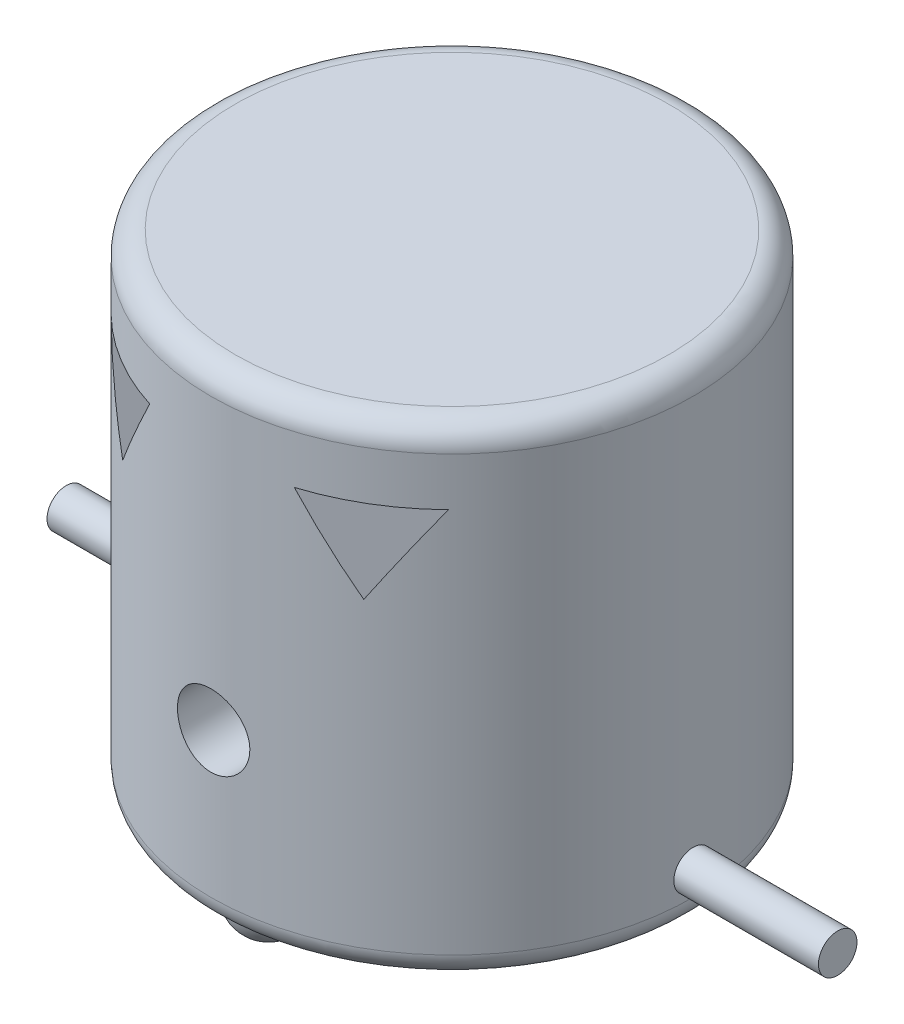
ISO-10303-21;
HEADER;
FILE_DESCRIPTION(('STEP AP214'),'2;1');
FILE_NAME('part.step','',(''),(''),'','','');
FILE_SCHEMA(('AUTOMOTIVE_DESIGN { 1 0 10303 214 1 1 1 1 }'));
ENDSEC;
DATA;
#1=APPLICATION_CONTEXT('core data for automotive mechanical design processes');
#2=APPLICATION_PROTOCOL_DEFINITION('international standard','automotive_design',2000,#1);
#3=PRODUCT_CONTEXT('',#1,'mechanical');
#4=PRODUCT('Part','Part','',(#3));
#5=PRODUCT_RELATED_PRODUCT_CATEGORY('part','',(#4));
#6=PRODUCT_DEFINITION_FORMATION('','',#4);
#7=PRODUCT_DEFINITION_CONTEXT('part definition',#1,'design');
#8=PRODUCT_DEFINITION('design','',#6,#7);
#9=PRODUCT_DEFINITION_SHAPE('','',#8);
#10=(LENGTH_UNIT() NAMED_UNIT(*) SI_UNIT(.MILLI.,.METRE.));
#11=(NAMED_UNIT(*) PLANE_ANGLE_UNIT() SI_UNIT($,.RADIAN.));
#12=(NAMED_UNIT(*) SI_UNIT($,.STERADIAN.) SOLID_ANGLE_UNIT());
#13=UNCERTAINTY_MEASURE_WITH_UNIT(LENGTH_MEASURE(1.E-05),#10,'distance_accuracy_value','');
#14=(GEOMETRIC_REPRESENTATION_CONTEXT(3) GLOBAL_UNCERTAINTY_ASSIGNED_CONTEXT((#13)) GLOBAL_UNIT_ASSIGNED_CONTEXT((#10,
#11,#12)) REPRESENTATION_CONTEXT('',''));
#15=CARTESIAN_POINT('',(0.,0.,0.));
#16=DIRECTION('',(0.,0.,1.));
#17=DIRECTION('',(1.,0.,0.));
#18=AXIS2_PLACEMENT_3D('',#15,#16,#17);
#19=CARTESIAN_POINT('',(-80.,10.,0.));
#20=DIRECTION('',(1.,0.,0.));
#21=DIRECTION('',(0.,0.,-1.));
#22=AXIS2_PLACEMENT_3D('',#19,#20,#21);
#23=CYLINDRICAL_SURFACE('',#22,4.);
#24=CARTESIAN_POINT('',(-80.,10.,0.));
#25=DIRECTION('',(-1.,0.,0.));
#26=DIRECTION('',(0.,0.,1.));
#27=AXIS2_PLACEMENT_3D('',#24,#25,#26);
#28=CIRCLE('',#27,4.);
#29=CARTESIAN_POINT('',(-80.,10.,4.));
#30=VERTEX_POINT('',#29);
#31=EDGE_CURVE('E11',#30,#30,#28,.T.);
#32=ORIENTED_EDGE('',*,*,#31,.F.);
#33=EDGE_LOOP('',(#32));
#34=FACE_BOUND('',#33,.T.);
#35=CARTESIAN_POINT('',(-50.,10.,0.));
#36=DIRECTION('',(-1.,0.,0.));
#37=DIRECTION('',(0.,0.,1.));
#38=AXIS2_PLACEMENT_3D('',#35,#36,#37);
#39=CIRCLE('',#38,4.);
#40=CARTESIAN_POINT('',(-50.,10.,4.));
#41=VERTEX_POINT('',#40);
#42=EDGE_CURVE('E48',#41,#41,#39,.T.);
#43=ORIENTED_EDGE('',*,*,#42,.T.);
#44=EDGE_LOOP('',(#43));
#45=FACE_BOUND('',#44,.T.);
#46=ADVANCED_FACE('F45',(#34,#45),#23,.T.);
#47=CARTESIAN_POINT('',(-80.,10.,0.));
#48=DIRECTION('',(-1.,0.,0.));
#49=DIRECTION('',(0.,0.,1.));
#50=AXIS2_PLACEMENT_3D('',#47,#48,#49);
#51=PLANE('',#50);
#52=ORIENTED_EDGE('',*,*,#31,.T.);
#53=EDGE_LOOP('',(#52));
#54=FACE_BOUND('',#53,.T.);
#55=ADVANCED_FACE('F60',(#54),#51,.T.);
#56=CARTESIAN_POINT('',(-50.,10.,0.));
#57=DIRECTION('',(-1.,0.,0.));
#58=DIRECTION('',(0.,0.,1.));
#59=AXIS2_PLACEMENT_3D('',#56,#57,#58);
#60=PLANE('',#59);
#61=ORIENTED_EDGE('',*,*,#42,.F.);
#62=EDGE_LOOP('',(#61));
#63=FACE_BOUND('',#62,.T.);
#64=ADVANCED_FACE('F58',(#63),#60,.F.);
#65=CLOSED_SHELL('',(#46,#55,#64));
#66=MANIFOLD_SOLID_BREP('B2',#65);
#67=CARTESIAN_POINT('',(80.,10.,0.));
#68=DIRECTION('',(-1.,0.,0.));
#69=DIRECTION('',(0.,0.,1.));
#70=AXIS2_PLACEMENT_3D('',#67,#68,#69);
#71=CYLINDRICAL_SURFACE('',#70,4.);
#72=CARTESIAN_POINT('',(80.,10.,0.));
#73=DIRECTION('',(1.,0.,0.));
#74=DIRECTION('',(0.,0.,-1.));
#75=AXIS2_PLACEMENT_3D('',#72,#73,#74);
#76=CIRCLE('',#75,4.);
#77=CARTESIAN_POINT('',(80.,10.,-4.));
#78=VERTEX_POINT('',#77);
#79=EDGE_CURVE('E44',#78,#78,#76,.T.);
#80=ORIENTED_EDGE('',*,*,#79,.F.);
#81=EDGE_LOOP('',(#80));
#82=FACE_BOUND('',#81,.T.);
#83=CARTESIAN_POINT('',(50.,10.,0.));
#84=DIRECTION('',(1.,0.,0.));
#85=DIRECTION('',(0.,0.,-1.));
#86=AXIS2_PLACEMENT_3D('',#83,#84,#85);
#87=CIRCLE('',#86,4.);
#88=CARTESIAN_POINT('',(50.,10.,-4.));
#89=VERTEX_POINT('',#88);
#90=EDGE_CURVE('E97',#89,#89,#87,.T.);
#91=ORIENTED_EDGE('',*,*,#90,.T.);
#92=EDGE_LOOP('',(#91));
#93=FACE_BOUND('',#92,.T.);
#94=ADVANCED_FACE('F94',(#82,#93),#71,.T.);
#95=CARTESIAN_POINT('',(80.,10.,0.));
#96=DIRECTION('',(1.,0.,0.));
#97=DIRECTION('',(0.,0.,-1.));
#98=AXIS2_PLACEMENT_3D('',#95,#96,#97);
#99=PLANE('',#98);
#100=ORIENTED_EDGE('',*,*,#79,.T.);
#101=EDGE_LOOP('',(#100));
#102=FACE_BOUND('',#101,.T.);
#103=ADVANCED_FACE('F109',(#102),#99,.T.);
#104=CARTESIAN_POINT('',(50.,10.,0.));
#105=DIRECTION('',(1.,0.,0.));
#106=DIRECTION('',(0.,0.,-1.));
#107=AXIS2_PLACEMENT_3D('',#104,#105,#106);
#108=PLANE('',#107);
#109=ORIENTED_EDGE('',*,*,#90,.F.);
#110=EDGE_LOOP('',(#109));
#111=FACE_BOUND('',#110,.T.);
#112=ADVANCED_FACE('F107',(#111),#108,.F.);
#113=CLOSED_SHELL('',(#94,#103,#112));
#114=MANIFOLD_SOLID_BREP('B6',#113);
#115=CARTESIAN_POINT('',(0.,100.,0.));
#116=DIRECTION('',(0.,-1.,0.));
#117=DIRECTION('',(0.,0.,-1.));
#118=AXIS2_PLACEMENT_3D('',#115,#116,#117);
#119=CYLINDRICAL_SURFACE('',#118,50.);
#120=CARTESIAN_POINT('',(-7.49999999999999,35.,49.434299833213));
#121=CARTESIAN_POINT('',(-7.50000285886689,34.7905635260125,49.4342986548373));
#122=CARTESIAN_POINT('',(-7.49122436038272,34.5811670776369,49.4356334342592));
#123=CARTESIAN_POINT('',(-7.45618073992245,34.1638107069092,49.4409314371976));
#124=CARTESIAN_POINT('',(-7.42991193559046,33.955851096382,49.4448952142145));
#125=CARTESIAN_POINT('',(-7.36005702919804,33.5427856650638,49.4553414791857));
#126=CARTESIAN_POINT('',(-7.31645912450807,33.3376818880922,49.4618256837046));
#127=CARTESIAN_POINT('',(-7.21225725506186,32.9318489234051,49.4771272133553));
#128=CARTESIAN_POINT('',(-7.15164705198759,32.7311213695798,49.485945394276));
#129=CARTESIAN_POINT('',(-7.01395763343412,32.3357615680786,49.5056484100164));
#130=CARTESIAN_POINT('',(-6.93689735937987,32.1411226027584,49.5165308663353));
#131=CARTESIAN_POINT('',(-6.76679848199266,31.7589822921436,49.5400626562028));
#132=CARTESIAN_POINT('',(-6.67375399109958,31.5714836080704,49.5527126404736));
#133=CARTESIAN_POINT('',(-6.47242661063779,31.2050867634391,49.5794109906652));
#134=CARTESIAN_POINT('',(-6.36415162641217,31.0261842053089,49.593458630037));
#135=CARTESIAN_POINT('',(-6.133047430475,30.6780327852966,49.6225683803889));
#136=CARTESIAN_POINT('',(-6.01021281697408,30.5087875411048,49.6376308669889));
#137=CARTESIAN_POINT('',(-5.74999260302425,30.1800594427643,49.6684493556388));
#138=CARTESIAN_POINT('',(-5.61251380798917,30.0206507311033,49.6842093743629));
#139=CARTESIAN_POINT('',(-5.32460397316708,29.713899709944,49.715888485961));
#140=CARTESIAN_POINT('',(-5.17416815881718,29.5665618878361,49.7318076355469));
#141=CARTESIAN_POINT('',(-4.86147613577769,29.2850820182447,49.7633472400344));
#142=CARTESIAN_POINT('',(-4.69922363070781,29.1509358669082,49.7789677866036));
#143=CARTESIAN_POINT('',(-4.36391276729286,28.896676980844,49.8094831433735));
#144=CARTESIAN_POINT('',(-4.19085044639889,28.7765694391172,49.8243776838381));
#145=CARTESIAN_POINT('',(-3.83434446194579,28.5507730800465,49.8530833959144));
#146=CARTESIAN_POINT('',(-3.65085643049168,28.4451536177109,49.8668892305384));
#147=CARTESIAN_POINT('',(-3.27551999504122,28.24976052718,49.8929489289839));
#148=CARTESIAN_POINT('',(-3.083671510982,28.1599870507735,49.9052027779385));
#149=CARTESIAN_POINT('',(-2.69298404083861,27.9969550993151,49.9278090501866));
#150=CARTESIAN_POINT('',(-2.49414544222185,27.923695710538,49.9381615786742));
#151=CARTESIAN_POINT('',(-2.09088597763369,27.7942355709973,49.9566705543195));
#152=CARTESIAN_POINT('',(-1.88646502676487,27.7380350798262,49.9648269680577));
#153=CARTESIAN_POINT('',(-1.47510875088328,27.6434894721691,49.9786561828903));
#154=CARTESIAN_POINT('',(-1.26820484834649,27.6050103764916,49.9843475999111));
#155=CARTESIAN_POINT('',(-0.851773037075269,27.5455555004316,49.9931783435598));
#156=CARTESIAN_POINT('',(-0.642244246570014,27.5245857711536,49.99631678789));
#157=CARTESIAN_POINT('',(-0.222213987471994,27.5003445465759,49.9999467023273));
#158=CARTESIAN_POINT('',(-0.0117129530035802,27.4970657969101,50.0004392574077));
#159=CARTESIAN_POINT('',(0.408831768888767,27.5081919010759,49.9987722232435));
#160=CARTESIAN_POINT('',(0.618875259428509,27.5226032650432,49.9966116576243));
#161=CARTESIAN_POINT('',(1.24250876363438,27.5919148824667,49.986269789156));
#162=CARTESIAN_POINT('',(1.65347650662672,27.6726753748765,49.9742599907323));
#163=CARTESIAN_POINT('',(2.45573109781224,27.9011535157063,49.94127640332));
#164=CARTESIAN_POINT('',(2.84701743917125,28.0488728874673,49.9203023836173));
#165=CARTESIAN_POINT('',(3.60080086431083,28.4076548541341,49.8716093186175));
#166=CARTESIAN_POINT('',(3.96318352631038,28.6189547905121,49.8438650752462));
#167=CARTESIAN_POINT('',(4.64754437137687,29.0987260033838,49.7847220128134));
#168=CARTESIAN_POINT('',(4.96951989258301,29.3672010432058,49.7533229532495));
#169=CARTESIAN_POINT('',(5.56727109959212,29.9568422343663,49.6900078822746));
#170=CARTESIAN_POINT('',(5.8425612968224,30.2785006063184,49.6580898237274));
#171=CARTESIAN_POINT('',(6.33533031766775,30.9637053891509,49.5976352301116));
#172=CARTESIAN_POINT('',(6.55280878527536,31.3272520579619,49.5690987158673));
#173=CARTESIAN_POINT('',(6.92384813778561,32.0864198103376,49.518638761956));
#174=CARTESIAN_POINT('',(7.07735910886066,32.4820656543802,49.4967204901608));
#175=CARTESIAN_POINT('',(7.31561681508707,33.2939262896677,49.4620701470565));
#176=CARTESIAN_POINT('',(7.40036839650597,33.7101396290897,49.4493374283425));
#177=CARTESIAN_POINT('',(7.49803607401169,34.5470003970337,49.4346225637822));
#178=CARTESIAN_POINT('',(7.51164044516935,34.9675657522318,49.432537418431));
#179=CARTESIAN_POINT('',(7.46845256908188,35.804971162873,49.4390804164445));
#180=CARTESIAN_POINT('',(7.41166250617308,36.2218113335041,49.4477082273865));
#181=CARTESIAN_POINT('',(7.22988620028407,37.0377983890999,49.4746100468584));
#182=CARTESIAN_POINT('',(7.10524284733838,37.4370234157214,49.4928355394406));
#183=CARTESIAN_POINT('',(6.79163767621335,38.2089230693585,49.5368403760048));
#184=CARTESIAN_POINT('',(6.60267268161791,38.5815963840633,49.5626200930308));
#185=CARTESIAN_POINT('',(6.16419864214208,39.2928564924455,49.6190667136796));
#186=CARTESIAN_POINT('',(5.91424443918737,39.6311655003159,49.6497689542022));
#187=CARTESIAN_POINT('',(5.36126562763825,40.26140103753,49.7125119816918));
#188=CARTESIAN_POINT('',(5.05823801814438,40.5533249423661,49.7445528442698));
#189=CARTESIAN_POINT('',(4.56924918197277,40.9512052693985,49.7910557642314));
#190=CARTESIAN_POINT('',(4.39964273536417,41.0776569090805,49.8063643967309));
#191=CARTESIAN_POINT('',(4.05031856859592,41.3158153249945,49.8359868100058));
#192=CARTESIAN_POINT('',(3.87060460557536,41.4275275291363,49.8503009560839));
#193=CARTESIAN_POINT('',(3.50224772636368,41.6354372381962,49.8775339174283));
#194=CARTESIAN_POINT('',(3.31360174656334,41.7316293692586,49.8904522488819));
#195=CARTESIAN_POINT('',(2.92882425103348,41.9077297680378,49.9145181567934));
#196=CARTESIAN_POINT('',(2.73269544384374,41.9876438627099,49.9256663665754));
#197=CARTESIAN_POINT('',(2.33498699286419,42.1303799103292,49.9458440617066));
#198=CARTESIAN_POINT('',(2.13342888462459,42.1932608401513,49.9548808424825));
#199=CARTESIAN_POINT('',(1.72564776310667,42.3018254799443,49.9706290507739));
#200=CARTESIAN_POINT('',(1.51942485970279,42.3475095945222,49.9773405329987));
#201=CARTESIAN_POINT('',(1.1038036930505,42.4213316586073,49.9882469057375));
#202=CARTESIAN_POINT('',(0.894405546743439,42.4494702527004,49.9924418887022));
#203=CARTESIAN_POINT('',(0.473949820149839,42.4879861435523,49.9981956909738));
#204=CARTESIAN_POINT('',(0.262892277350766,42.4983638403964,49.9997545696621));
#205=CARTESIAN_POINT('',(-0.157311194564286,42.5012647136879,50.0001897140101));
#206=CARTESIAN_POINT('',(-0.366455935367135,42.4939590660287,49.9990916986059));
#207=CARTESIAN_POINT('',(-0.783301309167071,42.4619112959478,49.9942983743573));
#208=CARTESIAN_POINT('',(-0.991002424145747,42.4371753062813,49.9906039790339));
#209=CARTESIAN_POINT('',(-1.40359226348109,42.3704550336334,49.9807214912808));
#210=CARTESIAN_POINT('',(-1.60848048313772,42.3284676960907,49.974532957237));
#211=CARTESIAN_POINT('',(-2.01395355423113,42.2275610083643,49.9598353634008));
#212=CARTESIAN_POINT('',(-2.21453849341197,42.1686420037713,49.9513263509715));
#213=CARTESIAN_POINT('',(-2.60985890753672,42.0343573182078,49.9322318041737));
#214=CARTESIAN_POINT('',(-2.80459853467777,41.9590036419233,49.9216477860581));
#215=CARTESIAN_POINT('',(-3.18702983063661,41.7923740902153,49.8986927740378));
#216=CARTESIAN_POINT('',(-3.37472155200585,41.7010983335406,49.8863217934607));
#217=CARTESIAN_POINT('',(-3.74180864692714,41.5032569301472,49.8601317675443));
#218=CARTESIAN_POINT('',(-3.92120231464142,41.3966881579396,49.8463124263544));
#219=CARTESIAN_POINT('',(-4.27036894001073,41.1690653166777,49.8176136471297));
#220=CARTESIAN_POINT('',(-4.4401452842612,41.0480163939036,49.8027345864779));
#221=CARTESIAN_POINT('',(-4.77059902158249,40.7909951115127,49.7721728551647));
#222=CARTESIAN_POINT('',(-4.93117183838967,40.6548890370557,49.7564837752549));
#223=CARTESIAN_POINT('',(-5.24024617615386,40.3697313908175,49.7248825984233));
#224=CARTESIAN_POINT('',(-5.38875201595653,40.2206844904972,49.708970583703));
#225=CARTESIAN_POINT('',(-5.67281744194091,39.9105385918109,49.6773548396208));
#226=CARTESIAN_POINT('',(-5.80836919057495,39.7494324010672,49.6616512412414));
#227=CARTESIAN_POINT('',(-6.06543256905434,39.4164189930335,49.6309105736997));
#228=CARTESIAN_POINT('',(-6.18694936243369,39.2445157841886,49.6158732606706));
#229=CARTESIAN_POINT('',(-6.415829979909,38.889975867109,49.5867978394759));
#230=CARTESIAN_POINT('',(-6.52310439000005,38.7072808788782,49.5727662770707));
#231=CARTESIAN_POINT('',(-6.72181990619548,38.3334563263053,49.546212634087));
#232=CARTESIAN_POINT('',(-6.81326683164345,38.1423298945529,49.5336899992329));
#233=CARTESIAN_POINT('',(-6.9796405865334,37.753067037728,49.5105208610859));
#234=CARTESIAN_POINT('',(-7.0545795333641,37.5549358791628,49.4998729828214));
#235=CARTESIAN_POINT('',(-7.18744237811995,37.1530161030521,49.480755484987));
#236=CARTESIAN_POINT('',(-7.24537009020548,36.9492287649352,49.4722853771832));
#237=CARTESIAN_POINT('',(-7.36270195057516,36.4582352895459,49.4549841062399));
#238=CARTESIAN_POINT('',(-7.41413110805992,36.169046260116,49.4472632880067));
#239=CARTESIAN_POINT('',(-7.48277790969411,35.5865452974107,49.4369220094735));
#240=CARTESIAN_POINT('',(-7.49999599728119,35.2932334176246,49.4343014830646));
#241=CARTESIAN_POINT('',(-7.49999999999999,35.,49.434299833213));
#242=B_SPLINE_CURVE_WITH_KNOTS('',3,(#120,#121,#122,#123,#124,#125,#126,#127,#128,#129,#130,
#131,#132,#133,#134,#135,#136,#137,#138,#139,#140,#141,#142,#143,#144,#145,#146,#147,#148,#149,
#150,#151,#152,#153,#154,#155,#156,#157,#158,#159,#160,#161,#162,#163,#164,#165,#166,#167,#168,
#169,#170,#171,#172,#173,#174,#175,#176,#177,#178,#179,#180,#181,#182,#183,#184,#185,#186,#187,
#188,#189,#190,#191,#192,#193,#194,#195,#196,#197,#198,#199,#200,#201,#202,#203,#204,#205,#206,
#207,#208,#209,#210,#211,#212,#213,#214,#215,#216,#217,#218,#219,#220,#221,#222,#223,#224,#225,
#226,#227,#228,#229,#230,#231,#232,#233,#234,#235,#236,#237,#238,#239,#240,#241),.UNSPECIFIED.,
.T.,.F.,(4,2,2,2,2,2,2,2,2,2,2,2,2,2,2,2,2,2,2,2,2,2,2,2,2,2,2,2,2,2,2,2,2,2,2,2,2,2,2,2,2,2,2,
2,2,2,2,2,2,2,2,2,2,2,2,2,2,2,2,2,4),(0.,0.628052492518364,1.25623725513125,1.88485060153753,
2.51369475888945,3.14181870247057,3.7701745046317,4.39820535582634,5.02646994732686,
5.65900321400067,6.29177056982292,6.9243404484473,7.55714358443453,8.19287747824411,
8.82861746142101,9.46432226043691,10.100036732758,10.7308627539158,11.3619066936455,
11.992691847717,12.6237092065342,13.8742496353519,15.1248222515356,16.3801223288882,
17.6355050570291,18.903233742879,20.170970235283,21.4396940982225,22.7083285317826,
23.9646672397661,25.2209669645879,26.4709762499607,27.7210472738978,28.9805308096571,
30.2400855826821,30.8757939307313,31.5112675170031,32.1469606672238,32.7824258605614,
33.4156618008793,34.0488828414759,34.6820806174786,35.3152641297642,35.9423429384195,
36.5692012234786,37.1961705493039,37.8231270790265,38.449627173794,39.0761225962483,
39.7027462406691,40.3291478395352,40.9616428233788,41.5939104270071,42.2265581780433,
42.8589724281872,43.4951860889716,44.1311653317512,44.7666761780789,45.4020444248678,
46.2813963471703,47.1607368713992),.UNSPECIFIED.);
#243=CARTESIAN_POINT('',(-7.49999999999999,35.,49.434299833213));
#244=VERTEX_POINT('',#243);
#245=EDGE_CURVE('E209',#244,#244,#242,.T.);
#246=ORIENTED_EDGE('',*,*,#245,.F.);
#247=EDGE_LOOP('',(#246));
#248=FACE_BOUND('',#247,.T.);
#249=CARTESIAN_POINT('',(0.,110.980762113533,0.));
#250=DIRECTION('',(0.866025403784439,0.5,0.));
#251=DIRECTION('',(0.5,-0.866025403784439,0.));
#252=AXIS2_PLACEMENT_3D('',#249,#250,#251);
#253=ELLIPSE('',#252,100.,50.);
#254=CARTESIAN_POINT('',(15.,85.,47.6969600708473));
#255=VERTEX_POINT('',#254);
#256=CARTESIAN_POINT('',(25.,67.6794919243112,43.3012701892219));
#257=VERTEX_POINT('',#256);
#258=EDGE_CURVE('E289',#255,#257,#253,.T.);
#259=ORIENTED_EDGE('',*,*,#258,.F.);
#260=CARTESIAN_POINT('',(0.,85.,0.));
#261=DIRECTION('',(0.,-1.,0.));
#262=DIRECTION('',(0.,0.,-1.));
#263=AXIS2_PLACEMENT_3D('',#260,#261,#262);
#264=CIRCLE('',#263,50.);
#265=CARTESIAN_POINT('',(35.,85.,35.7071421427143));
#266=VERTEX_POINT('',#265);
#267=EDGE_CURVE('E283',#266,#255,#264,.T.);
#268=ORIENTED_EDGE('',*,*,#267,.F.);
#269=CARTESIAN_POINT('',(0.,24.3782217350893,0.));
#270=DIRECTION('',(-0.866025403784439,0.5,0.));
#271=DIRECTION('',(-0.5,-0.866025403784439,0.));
#272=AXIS2_PLACEMENT_3D('',#269,#270,#271);
#273=ELLIPSE('',#272,100.,50.);
#274=EDGE_CURVE('E286',#257,#266,#273,.T.);
#275=ORIENTED_EDGE('',*,*,#274,.F.);
#276=EDGE_LOOP('',(#259,#268,#275));
#277=FACE_BOUND('',#276,.T.);
#278=CARTESIAN_POINT('',(0.,5.,0.));
#279=DIRECTION('',(0.,1.,0.));
#280=DIRECTION('',(0.,0.,1.));
#281=AXIS2_PLACEMENT_3D('',#278,#279,#280);
#282=CIRCLE('',#281,50.);
#283=CARTESIAN_POINT('',(0.,5.,50.));
#284=VERTEX_POINT('',#283);
#285=EDGE_CURVE('E268',#284,#284,#282,.T.);
#286=ORIENTED_EDGE('',*,*,#285,.T.);
#287=EDGE_LOOP('',(#286));
#288=FACE_BOUND('',#287,.T.);
#289=CARTESIAN_POINT('',(0.,95.,0.));
#290=DIRECTION('',(0.,1.,0.));
#291=DIRECTION('',(0.,0.,1.));
#292=AXIS2_PLACEMENT_3D('',#289,#290,#291);
#293=CIRCLE('',#292,50.);
#294=CARTESIAN_POINT('',(0.,95.,50.));
#295=VERTEX_POINT('',#294);
#296=EDGE_CURVE('E264',#295,#295,#293,.F.);
#297=ORIENTED_EDGE('',*,*,#296,.T.);
#298=EDGE_LOOP('',(#297));
#299=FACE_BOUND('',#298,.T.);
#300=CARTESIAN_POINT('',(0.,24.3782217350893,0.));
#301=DIRECTION('',(0.866025403784439,0.5,0.));
#302=DIRECTION('',(0.5,-0.866025403784439,0.));
#303=AXIS2_PLACEMENT_3D('',#300,#301,#302);
#304=ELLIPSE('',#303,100.,50.);
#305=CARTESIAN_POINT('',(-35.,85.,35.7071421427143));
#306=VERTEX_POINT('',#305);
#307=CARTESIAN_POINT('',(-25.,67.6794919243112,43.3012701892219));
#308=VERTEX_POINT('',#307);
#309=EDGE_CURVE('E92',#306,#308,#304,.T.);
#310=ORIENTED_EDGE('',*,*,#309,.F.);
#311=CARTESIAN_POINT('',(0.,85.,0.));
#312=DIRECTION('',(0.,-1.,0.));
#313=DIRECTION('',(0.,0.,-1.));
#314=AXIS2_PLACEMENT_3D('',#311,#312,#313);
#315=CIRCLE('',#314,50.);
#316=CARTESIAN_POINT('',(-15.,85.,47.6969600708473));
#317=VERTEX_POINT('',#316);
#318=EDGE_CURVE('E292',#317,#306,#315,.T.);
#319=ORIENTED_EDGE('',*,*,#318,.F.);
#320=CARTESIAN_POINT('',(0.,110.980762113533,0.));
#321=DIRECTION('',(-0.866025403784439,0.5,0.));
#322=DIRECTION('',(-0.5,-0.866025403784439,0.));
#323=AXIS2_PLACEMENT_3D('',#320,#321,#322);
#324=ELLIPSE('',#323,100.,50.);
#325=EDGE_CURVE('E143',#308,#317,#324,.T.);
#326=ORIENTED_EDGE('',*,*,#325,.F.);
#327=EDGE_LOOP('',(#310,#319,#326));
#328=FACE_BOUND('',#327,.T.);
#329=ADVANCED_FACE('F134',(#248,#277,#288,#299,#328),#119,.T.);
#330=CARTESIAN_POINT('',(0.,100.,0.));
#331=DIRECTION('',(0.,1.,0.));
#332=DIRECTION('',(0.,0.,1.));
#333=AXIS2_PLACEMENT_3D('',#330,#331,#332);
#334=PLANE('',#333);
#335=CARTESIAN_POINT('',(0.,100.,0.));
#336=DIRECTION('',(0.,1.,0.));
#337=DIRECTION('',(0.,0.,1.));
#338=AXIS2_PLACEMENT_3D('',#335,#336,#337);
#339=CIRCLE('',#338,45.);
#340=CARTESIAN_POINT('',(0.,100.,45.));
#341=VERTEX_POINT('',#340);
#342=EDGE_CURVE('E277',#341,#341,#339,.T.);
#343=ORIENTED_EDGE('',*,*,#342,.T.);
#344=EDGE_LOOP('',(#343));
#345=FACE_BOUND('',#344,.T.);
#346=ADVANCED_FACE('F342',(#345),#334,.T.);
#347=CARTESIAN_POINT('',(0.,0.,0.));
#348=DIRECTION('',(0.,1.,0.));
#349=DIRECTION('',(0.,0.,1.));
#350=AXIS2_PLACEMENT_3D('',#347,#348,#349);
#351=PLANE('',#350);
#352=CARTESIAN_POINT('',(0.,0.,-38.));
#353=DIRECTION('',(0.,-1.,0.));
#354=DIRECTION('',(0.,0.,-1.));
#355=AXIS2_PLACEMENT_3D('',#352,#353,#354);
#356=CIRCLE('',#355,7.4);
#357=CARTESIAN_POINT('',(2.61061459952588,0.,-44.9242105263158));
#358=VERTEX_POINT('',#357);
#359=CARTESIAN_POINT('',(-2.61061459952586,0.,-44.9242105263158));
#360=VERTEX_POINT('',#359);
#361=EDGE_CURVE('E254',#358,#360,#356,.T.);
#362=ORIENTED_EDGE('',*,*,#361,.F.);
#363=CARTESIAN_POINT('',(0.,0.,0.));
#364=DIRECTION('',(0.,1.,0.));
#365=DIRECTION('',(0.,0.,1.));
#366=AXIS2_PLACEMENT_3D('',#363,#364,#365);
#367=CIRCLE('',#366,45.);
#368=CARTESIAN_POINT('',(2.6106145995427,0.,44.9242105263148));
#369=VERTEX_POINT('',#368);
#370=EDGE_CURVE('E279',#358,#369,#367,.F.);
#371=ORIENTED_EDGE('',*,*,#370,.T.);
#372=CARTESIAN_POINT('',(0.,0.,38.));
#373=DIRECTION('',(0.,1.,0.));
#374=DIRECTION('',(0.,0.,1.));
#375=AXIS2_PLACEMENT_3D('',#372,#373,#374);
#376=CIRCLE('',#375,7.4);
#377=CARTESIAN_POINT('',(-2.61061459952542,0.,44.924210526316));
#378=VERTEX_POINT('',#377);
#379=EDGE_CURVE('E260',#369,#378,#376,.T.);
#380=ORIENTED_EDGE('',*,*,#379,.T.);
#381=EDGE_CURVE('E273',#378,#360,#367,.F.);
#382=ORIENTED_EDGE('',*,*,#381,.T.);
#383=EDGE_LOOP('',(#362,#371,#380,#382));
#384=FACE_BOUND('',#383,.T.);
#385=ADVANCED_FACE('F344',(#384),#351,.F.);
#386=CARTESIAN_POINT('',(0.,5.,0.));
#387=DIRECTION('',(0.,1.,0.));
#388=DIRECTION('',(0.,0.,1.));
#389=AXIS2_PLACEMENT_3D('',#386,#387,#388);
#390=TOROIDAL_SURFACE('',#389,45.,5.);
#391=ORIENTED_EDGE('',*,*,#381,.F.);
#392=EDGE_CURVE('E272',#369,#378,#367,.F.);
#393=ORIENTED_EDGE('',*,*,#392,.F.);
#394=ORIENTED_EDGE('',*,*,#370,.F.);
#395=EDGE_CURVE('E278',#360,#358,#367,.F.);
#396=ORIENTED_EDGE('',*,*,#395,.F.);
#397=EDGE_LOOP('',(#391,#393,#394,#396));
#398=FACE_BOUND('',#397,.T.);
#399=ORIENTED_EDGE('',*,*,#285,.F.);
#400=EDGE_LOOP('',(#399));
#401=FACE_BOUND('',#400,.T.);
#402=ADVANCED_FACE('F347',(#398,#401),#390,.T.);
#403=CARTESIAN_POINT('',(0.,95.,0.));
#404=DIRECTION('',(0.,1.,0.));
#405=DIRECTION('',(0.,0.,1.));
#406=AXIS2_PLACEMENT_3D('',#403,#404,#405);
#407=TOROIDAL_SURFACE('',#406,45.,5.);
#408=ORIENTED_EDGE('',*,*,#296,.F.);
#409=EDGE_LOOP('',(#408));
#410=FACE_BOUND('',#409,.T.);
#411=ORIENTED_EDGE('',*,*,#342,.F.);
#412=EDGE_LOOP('',(#411));
#413=FACE_BOUND('',#412,.T.);
#414=ADVANCED_FACE('F136',(#410,#413),#407,.T.);
#415=CARTESIAN_POINT('',(0.,0.,30.6));
#416=DIRECTION('',(0.,-1.,0.));
#417=DIRECTION('',(0.,0.,-1.));
#418=AXIS2_PLACEMENT_3D('',#415,#416,#417);
#419=PLANE('',#418);
#420=EDGE_CURVE('E258',#378,#369,#376,.T.);
#421=ORIENTED_EDGE('',*,*,#420,.T.);
#422=ORIENTED_EDGE('',*,*,#392,.T.);
#423=EDGE_LOOP('',(#421,#422));
#424=FACE_BOUND('',#423,.T.);
#425=ADVANCED_FACE('F337',(#424),#419,.F.);
#426=CARTESIAN_POINT('',(0.,0.,38.));
#427=DIRECTION('',(0.,1.,0.));
#428=DIRECTION('',(0.,0.,-1.));
#429=AXIS2_PLACEMENT_3D('',#426,#427,#428);
#430=SPHERICAL_SURFACE('',#429,7.4);
#431=ORIENTED_EDGE('',*,*,#379,.F.);
#432=ORIENTED_EDGE('',*,*,#420,.F.);
#433=EDGE_LOOP('',(#431,#432));
#434=FACE_BOUND('',#433,.T.);
#435=ADVANCED_FACE('F333',(#434),#430,.T.);
#436=CARTESIAN_POINT('',(0.,0.,-30.6));
#437=DIRECTION('',(0.,-1.,0.));
#438=DIRECTION('',(0.,0.,1.));
#439=AXIS2_PLACEMENT_3D('',#436,#437,#438);
#440=PLANE('',#439);
#441=EDGE_CURVE('E259',#360,#358,#356,.T.);
#442=ORIENTED_EDGE('',*,*,#441,.F.);
#443=ORIENTED_EDGE('',*,*,#395,.T.);
#444=EDGE_LOOP('',(#442,#443));
#445=FACE_BOUND('',#444,.T.);
#446=ADVANCED_FACE('F329',(#445),#440,.F.);
#447=CARTESIAN_POINT('',(0.,0.,-38.));
#448=DIRECTION('',(0.,1.,0.));
#449=DIRECTION('',(0.,0.,1.));
#450=AXIS2_PLACEMENT_3D('',#447,#448,#449);
#451=SPHERICAL_SURFACE('',#450,7.4);
#452=ORIENTED_EDGE('',*,*,#361,.T.);
#453=ORIENTED_EDGE('',*,*,#441,.T.);
#454=EDGE_LOOP('',(#452,#453));
#455=FACE_BOUND('',#454,.T.);
#456=ADVANCED_FACE('F325',(#455),#451,.T.);
#457=CARTESIAN_POINT('',(15.,85.,65.));
#458=DIRECTION('',(0.866025403784439,0.5,0.));
#459=DIRECTION('',(-0.5,0.866025403784439,0.));
#460=AXIS2_PLACEMENT_3D('',#457,#458,#459);
#461=PLANE('',#460);
#462=ORIENTED_EDGE('',*,*,#258,.T.);
#463=DIRECTION('',(0.,0.,-1.));
#464=VECTOR('',#463,1.);
#465=CARTESIAN_POINT('',(25.,67.6794919243112,65.));
#466=LINE('',#465,#464);
#467=CARTESIAN_POINT('',(25.,67.6794919243112,0.));
#468=VERTEX_POINT('',#467);
#469=EDGE_CURVE('E225',#257,#468,#466,.T.);
#470=ORIENTED_EDGE('',*,*,#469,.T.);
#471=DIRECTION('',(0.5,-0.866025403784439,0.));
#472=VECTOR('',#471,1.);
#473=CARTESIAN_POINT('',(15.,85.,0.));
#474=LINE('',#473,#472);
#475=CARTESIAN_POINT('',(15.,85.,0.));
#476=VERTEX_POINT('',#475);
#477=EDGE_CURVE('E235',#476,#468,#474,.T.);
#478=ORIENTED_EDGE('',*,*,#477,.F.);
#479=DIRECTION('',(0.,0.,-1.));
#480=VECTOR('',#479,1.);
#481=CARTESIAN_POINT('',(15.,85.,65.));
#482=LINE('',#481,#480);
#483=EDGE_CURVE('E247',#255,#476,#482,.T.);
#484=ORIENTED_EDGE('',*,*,#483,.F.);
#485=EDGE_LOOP('',(#462,#470,#478,#484));
#486=FACE_BOUND('',#485,.T.);
#487=ADVANCED_FACE('F321',(#486),#461,.T.);
#488=CARTESIAN_POINT('',(25.,67.6794919243112,65.));
#489=DIRECTION('',(-0.866025403784439,0.5,0.));
#490=DIRECTION('',(-0.5,-0.866025403784439,0.));
#491=AXIS2_PLACEMENT_3D('',#488,#489,#490);
#492=PLANE('',#491);
#493=ORIENTED_EDGE('',*,*,#274,.T.);
#494=DIRECTION('',(0.,0.,-1.));
#495=VECTOR('',#494,1.);
#496=CARTESIAN_POINT('',(35.,85.,65.));
#497=LINE('',#496,#495);
#498=CARTESIAN_POINT('',(35.,85.,0.));
#499=VERTEX_POINT('',#498);
#500=EDGE_CURVE('E158',#266,#499,#497,.T.);
#501=ORIENTED_EDGE('',*,*,#500,.T.);
#502=DIRECTION('',(0.5,0.866025403784439,0.));
#503=VECTOR('',#502,1.);
#504=CARTESIAN_POINT('',(25.,67.6794919243112,0.));
#505=LINE('',#504,#503);
#506=EDGE_CURVE('E239',#468,#499,#505,.T.);
#507=ORIENTED_EDGE('',*,*,#506,.F.);
#508=ORIENTED_EDGE('',*,*,#469,.F.);
#509=EDGE_LOOP('',(#493,#501,#507,#508));
#510=FACE_BOUND('',#509,.T.);
#511=ADVANCED_FACE('F318',(#510),#492,.T.);
#512=CARTESIAN_POINT('',(35.,85.,65.));
#513=DIRECTION('',(0.,-1.,0.));
#514=DIRECTION('',(0.,0.,-1.));
#515=AXIS2_PLACEMENT_3D('',#512,#513,#514);
#516=PLANE('',#515);
#517=ORIENTED_EDGE('',*,*,#267,.T.);
#518=ORIENTED_EDGE('',*,*,#483,.T.);
#519=DIRECTION('',(-1.,0.,0.));
#520=VECTOR('',#519,1.);
#521=CARTESIAN_POINT('',(35.,85.,0.));
#522=LINE('',#521,#520);
#523=EDGE_CURVE('E243',#499,#476,#522,.T.);
#524=ORIENTED_EDGE('',*,*,#523,.F.);
#525=ORIENTED_EDGE('',*,*,#500,.F.);
#526=EDGE_LOOP('',(#517,#518,#524,#525));
#527=FACE_BOUND('',#526,.T.);
#528=ADVANCED_FACE('F314',(#527),#516,.T.);
#529=CARTESIAN_POINT('',(0.,0.,0.));
#530=DIRECTION('',(0.,0.,1.));
#531=DIRECTION('',(1.,0.,0.));
#532=AXIS2_PLACEMENT_3D('',#529,#530,#531);
#533=PLANE('',#532);
#534=ORIENTED_EDGE('',*,*,#477,.T.);
#535=ORIENTED_EDGE('',*,*,#506,.T.);
#536=ORIENTED_EDGE('',*,*,#523,.T.);
#537=EDGE_LOOP('',(#534,#535,#536));
#538=FACE_BOUND('',#537,.T.);
#539=ADVANCED_FACE('F309',(#538),#533,.T.);
#540=CARTESIAN_POINT('',(0.,35.,65.));
#541=DIRECTION('',(0.,0.,-1.));
#542=DIRECTION('',(-1.,0.,0.));
#543=AXIS2_PLACEMENT_3D('',#540,#541,#542);
#544=CYLINDRICAL_SURFACE('',#543,7.5);
#545=CARTESIAN_POINT('',(0.,35.,0.));
#546=DIRECTION('',(0.,0.,1.));
#547=DIRECTION('',(1.,0.,0.));
#548=AXIS2_PLACEMENT_3D('',#545,#546,#547);
#549=CIRCLE('',#548,7.5);
#550=CARTESIAN_POINT('',(7.50000000000001,35.,0.));
#551=VERTEX_POINT('',#550);
#552=EDGE_CURVE('E221',#551,#551,#549,.T.);
#553=ORIENTED_EDGE('',*,*,#552,.F.);
#554=EDGE_LOOP('',(#553));
#555=FACE_BOUND('',#554,.T.);
#556=ORIENTED_EDGE('',*,*,#245,.T.);
#557=EDGE_LOOP('',(#556));
#558=FACE_BOUND('',#557,.T.);
#559=ADVANCED_FACE('F303',(#555,#558),#544,.F.);
#560=CARTESIAN_POINT('',(0.,35.,0.));
#561=DIRECTION('',(0.,0.,1.));
#562=DIRECTION('',(1.,0.,0.));
#563=AXIS2_PLACEMENT_3D('',#560,#561,#562);
#564=PLANE('',#563);
#565=ORIENTED_EDGE('',*,*,#552,.T.);
#566=EDGE_LOOP('',(#565));
#567=FACE_BOUND('',#566,.T.);
#568=ADVANCED_FACE('F308',(#567),#564,.T.);
#569=CARTESIAN_POINT('',(-25.,67.6794919243112,65.));
#570=DIRECTION('',(0.866025403784439,0.5,0.));
#571=DIRECTION('',(-0.5,0.866025403784439,0.));
#572=AXIS2_PLACEMENT_3D('',#569,#570,#571);
#573=PLANE('',#572);
#574=ORIENTED_EDGE('',*,*,#309,.T.);
#575=DIRECTION('',(0.,0.,-1.));
#576=VECTOR('',#575,1.);
#577=CARTESIAN_POINT('',(-25.,67.6794919243112,65.));
#578=LINE('',#577,#576);
#579=CARTESIAN_POINT('',(-25.,67.6794919243112,0.));
#580=VERTEX_POINT('',#579);
#581=EDGE_CURVE('E199',#308,#580,#578,.T.);
#582=ORIENTED_EDGE('',*,*,#581,.T.);
#583=DIRECTION('',(0.5,-0.866025403784439,0.));
#584=VECTOR('',#583,1.);
#585=CARTESIAN_POINT('',(-25.,67.6794919243112,0.));
#586=LINE('',#585,#584);
#587=CARTESIAN_POINT('',(-35.,85.,0.));
#588=VERTEX_POINT('',#587);
#589=EDGE_CURVE('E204',#588,#580,#586,.T.);
#590=ORIENTED_EDGE('',*,*,#589,.F.);
#591=DIRECTION('',(0.,0.,-1.));
#592=VECTOR('',#591,1.);
#593=CARTESIAN_POINT('',(-35.,85.,65.));
#594=LINE('',#593,#592);
#595=EDGE_CURVE('E230',#306,#588,#594,.T.);
#596=ORIENTED_EDGE('',*,*,#595,.F.);
#597=EDGE_LOOP('',(#574,#582,#590,#596));
#598=FACE_BOUND('',#597,.T.);
#599=ADVANCED_FACE('F201',(#598),#573,.T.);
#600=CARTESIAN_POINT('',(-15.,85.,65.));
#601=DIRECTION('',(-0.866025403784439,0.5,0.));
#602=DIRECTION('',(-0.5,-0.866025403784439,0.));
#603=AXIS2_PLACEMENT_3D('',#600,#601,#602);
#604=PLANE('',#603);
#605=ORIENTED_EDGE('',*,*,#325,.T.);
#606=DIRECTION('',(0.,0.,-1.));
#607=VECTOR('',#606,1.);
#608=CARTESIAN_POINT('',(-15.,85.,65.));
#609=LINE('',#608,#607);
#610=CARTESIAN_POINT('',(-15.,85.,0.));
#611=VERTEX_POINT('',#610);
#612=EDGE_CURVE('E150',#317,#611,#609,.T.);
#613=ORIENTED_EDGE('',*,*,#612,.T.);
#614=DIRECTION('',(0.5,0.866025403784439,0.));
#615=VECTOR('',#614,1.);
#616=CARTESIAN_POINT('',(-15.,85.,0.));
#617=LINE('',#616,#615);
#618=EDGE_CURVE('E212',#580,#611,#617,.T.);
#619=ORIENTED_EDGE('',*,*,#618,.F.);
#620=ORIENTED_EDGE('',*,*,#581,.F.);
#621=EDGE_LOOP('',(#605,#613,#619,#620));
#622=FACE_BOUND('',#621,.T.);
#623=ADVANCED_FACE('F213',(#622),#604,.T.);
#624=CARTESIAN_POINT('',(-35.,85.,65.));
#625=DIRECTION('',(0.,-1.,0.));
#626=DIRECTION('',(0.,0.,-1.));
#627=AXIS2_PLACEMENT_3D('',#624,#625,#626);
#628=PLANE('',#627);
#629=ORIENTED_EDGE('',*,*,#318,.T.);
#630=ORIENTED_EDGE('',*,*,#595,.T.);
#631=DIRECTION('',(-1.,0.,0.));
#632=VECTOR('',#631,1.);
#633=CARTESIAN_POINT('',(-35.,85.,0.));
#634=LINE('',#633,#632);
#635=EDGE_CURVE('E217',#611,#588,#634,.T.);
#636=ORIENTED_EDGE('',*,*,#635,.F.);
#637=ORIENTED_EDGE('',*,*,#612,.F.);
#638=EDGE_LOOP('',(#629,#630,#636,#637));
#639=FACE_BOUND('',#638,.T.);
#640=ADVANCED_FACE('F374',(#639),#628,.T.);
#641=CARTESIAN_POINT('',(0.,0.,0.));
#642=DIRECTION('',(0.,0.,-1.));
#643=DIRECTION('',(-1.,0.,0.));
#644=AXIS2_PLACEMENT_3D('',#641,#642,#643);
#645=PLANE('',#644);
#646=ORIENTED_EDGE('',*,*,#589,.T.);
#647=ORIENTED_EDGE('',*,*,#618,.T.);
#648=ORIENTED_EDGE('',*,*,#635,.T.);
#649=EDGE_LOOP('',(#646,#647,#648));
#650=FACE_BOUND('',#649,.T.);
#651=ADVANCED_FACE('F219',(#650),#645,.F.);
#652=CLOSED_SHELL('',(#329,#346,#385,#402,#414,#425,#435,#446,#456,#487,#511,#528,#539,#559,
#568,#599,#623,#640,#651));
#653=MANIFOLD_SOLID_BREP('B39',#652);
#654=ADVANCED_BREP_SHAPE_REPRESENTATION('',(#18,#66,#114,#653),#14);
#655=SHAPE_DEFINITION_REPRESENTATION(#9,#654);
ENDSEC;
END-ISO-10303-21;
